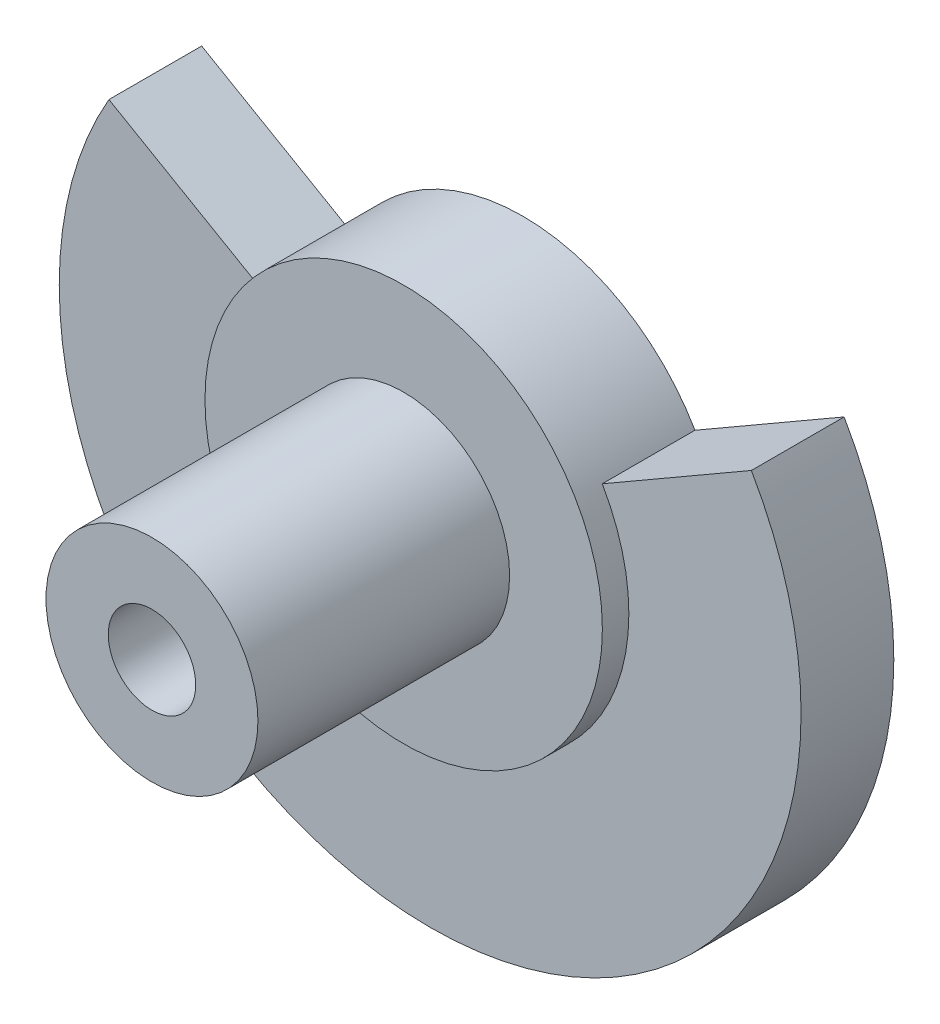
ISO-10303-21;
HEADER;
FILE_DESCRIPTION(('STEP AP214'),'2;1');
FILE_NAME('part.step','',(''),(''),'','','');
FILE_SCHEMA(('AUTOMOTIVE_DESIGN { 1 0 10303 214 1 1 1 1 }'));
ENDSEC;
DATA;
#1=APPLICATION_CONTEXT('core data for automotive mechanical design processes');
#2=APPLICATION_PROTOCOL_DEFINITION('international standard','automotive_design',2000,#1);
#3=PRODUCT_CONTEXT('',#1,'mechanical');
#4=PRODUCT('Part','Part','',(#3));
#5=PRODUCT_RELATED_PRODUCT_CATEGORY('part','',(#4));
#6=PRODUCT_DEFINITION_FORMATION('','',#4);
#7=PRODUCT_DEFINITION_CONTEXT('part definition',#1,'design');
#8=PRODUCT_DEFINITION('design','',#6,#7);
#9=PRODUCT_DEFINITION_SHAPE('','',#8);
#10=(LENGTH_UNIT() NAMED_UNIT(*) SI_UNIT(.MILLI.,.METRE.));
#11=(NAMED_UNIT(*) PLANE_ANGLE_UNIT() SI_UNIT($,.RADIAN.));
#12=(NAMED_UNIT(*) SI_UNIT($,.STERADIAN.) SOLID_ANGLE_UNIT());
#13=UNCERTAINTY_MEASURE_WITH_UNIT(LENGTH_MEASURE(1.E-05),#10,'distance_accuracy_value','');
#14=(GEOMETRIC_REPRESENTATION_CONTEXT(3) GLOBAL_UNCERTAINTY_ASSIGNED_CONTEXT((#13)) GLOBAL_UNIT_ASSIGNED_CONTEXT((#10,
#11,#12)) REPRESENTATION_CONTEXT('',''));
#15=CARTESIAN_POINT('',(0.,0.,0.));
#16=DIRECTION('',(0.,0.,1.));
#17=DIRECTION('',(1.,0.,0.));
#18=AXIS2_PLACEMENT_3D('',#15,#16,#17);
#19=CARTESIAN_POINT('',(0.,0.,14.));
#20=DIRECTION('',(0.,0.,-1.));
#21=DIRECTION('',(-1.,0.,0.));
#22=AXIS2_PLACEMENT_3D('',#19,#20,#21);
#23=CYLINDRICAL_SURFACE('',#22,14.);
#24=CARTESIAN_POINT('',(0.,0.,3.5));
#25=DIRECTION('',(0.,0.,1.));
#26=DIRECTION('',(1.,0.,0.));
#27=AXIS2_PLACEMENT_3D('',#24,#25,#26);
#28=CIRCLE('',#27,14.);
#29=CARTESIAN_POINT('',(-12.1243556529822,6.99999999999997,3.5));
#30=VERTEX_POINT('',#29);
#31=CARTESIAN_POINT('',(12.1243556529822,6.99999999999997,3.5));
#32=VERTEX_POINT('',#31);
#33=EDGE_CURVE('E97',#30,#32,#28,.T.);
#34=ORIENTED_EDGE('',*,*,#33,.F.);
#35=DIRECTION('',(0.,0.,1.));
#36=VECTOR('',#35,1.);
#37=CARTESIAN_POINT('',(-12.1243556529822,6.99999999999997,0.));
#38=LINE('',#37,#36);
#39=CARTESIAN_POINT('',(-12.1243556529822,6.99999999999997,0.));
#40=VERTEX_POINT('',#39);
#41=EDGE_CURVE('E68',#40,#30,#38,.T.);
#42=ORIENTED_EDGE('',*,*,#41,.F.);
#43=CARTESIAN_POINT('',(0.,0.,0.));
#44=DIRECTION('',(0.,0.,1.));
#45=DIRECTION('',(1.,0.,0.));
#46=AXIS2_PLACEMENT_3D('',#43,#44,#45);
#47=CIRCLE('',#46,14.);
#48=CARTESIAN_POINT('',(12.1243556529822,6.99999999999997,0.));
#49=VERTEX_POINT('',#48);
#50=EDGE_CURVE('E11',#40,#49,#47,.T.);
#51=ORIENTED_EDGE('',*,*,#50,.T.);
#52=DIRECTION('',(0.,0.,1.));
#53=VECTOR('',#52,1.);
#54=CARTESIAN_POINT('',(12.1243556529822,6.99999999999997,0.));
#55=LINE('',#54,#53);
#56=EDGE_CURVE('E78',#49,#32,#55,.T.);
#57=ORIENTED_EDGE('',*,*,#56,.T.);
#58=EDGE_LOOP('',(#34,#42,#51,#57));
#59=FACE_BOUND('',#58,.T.);
#60=ADVANCED_FACE('F35',(#59),#23,.T.);
#61=CARTESIAN_POINT('',(0.,0.,4.5));
#62=DIRECTION('',(0.,0.,1.));
#63=DIRECTION('',(1.,0.,0.));
#64=AXIS2_PLACEMENT_3D('',#61,#62,#63);
#65=PLANE('',#64);
#66=CARTESIAN_POINT('',(0.,0.,4.5));
#67=DIRECTION('',(0.,0.,1.));
#68=DIRECTION('',(1.,0.,0.));
#69=AXIS2_PLACEMENT_3D('',#66,#67,#68);
#70=CIRCLE('',#69,4.);
#71=CARTESIAN_POINT('',(4.,0.,4.5));
#72=VERTEX_POINT('',#71);
#73=EDGE_CURVE('E110',#72,#72,#70,.T.);
#74=ORIENTED_EDGE('',*,*,#73,.F.);
#75=EDGE_LOOP('',(#74));
#76=FACE_BOUND('',#75,.T.);
#77=CARTESIAN_POINT('',(0.,0.,4.5));
#78=DIRECTION('',(0.,0.,1.));
#79=DIRECTION('',(1.,0.,0.));
#80=AXIS2_PLACEMENT_3D('',#77,#78,#79);
#81=CIRCLE('',#80,7.5);
#82=CARTESIAN_POINT('',(7.5,0.,4.5));
#83=VERTEX_POINT('',#82);
#84=EDGE_CURVE('E99',#83,#83,#81,.T.);
#85=ORIENTED_EDGE('',*,*,#84,.T.);
#86=EDGE_LOOP('',(#85));
#87=FACE_BOUND('',#86,.T.);
#88=ADVANCED_FACE('F137',(#76,#87),#65,.T.);
#89=CARTESIAN_POINT('',(0.,0.,14.));
#90=DIRECTION('',(0.,0.,1.));
#91=DIRECTION('',(1.,0.,0.));
#92=AXIS2_PLACEMENT_3D('',#89,#90,#91);
#93=PLANE('',#92);
#94=CARTESIAN_POINT('',(0.,0.,14.));
#95=DIRECTION('',(0.,0.,1.));
#96=DIRECTION('',(1.,0.,0.));
#97=AXIS2_PLACEMENT_3D('',#94,#95,#96);
#98=CIRCLE('',#97,1.65);
#99=CARTESIAN_POINT('',(1.65,0.,14.));
#100=VERTEX_POINT('',#99);
#101=EDGE_CURVE('E42',#100,#100,#98,.T.);
#102=ORIENTED_EDGE('',*,*,#101,.F.);
#103=EDGE_LOOP('',(#102));
#104=FACE_BOUND('',#103,.T.);
#105=CARTESIAN_POINT('',(0.,0.,14.));
#106=DIRECTION('',(0.,0.,1.));
#107=DIRECTION('',(1.,0.,0.));
#108=AXIS2_PLACEMENT_3D('',#105,#106,#107);
#109=CIRCLE('',#108,4.);
#110=CARTESIAN_POINT('',(4.,0.,14.));
#111=VERTEX_POINT('',#110);
#112=EDGE_CURVE('E109',#111,#111,#109,.T.);
#113=ORIENTED_EDGE('',*,*,#112,.T.);
#114=EDGE_LOOP('',(#113));
#115=FACE_BOUND('',#114,.T.);
#116=ADVANCED_FACE('F133',(#104,#115),#93,.T.);
#117=CARTESIAN_POINT('',(0.,0.,0.));
#118=DIRECTION('',(0.,0.,1.));
#119=DIRECTION('',(1.,0.,0.));
#120=AXIS2_PLACEMENT_3D('',#117,#118,#119);
#121=PLANE('',#120);
#122=ORIENTED_EDGE('',*,*,#50,.F.);
#123=DIRECTION('',(0.86602540378444,-0.499999999999998,0.));
#124=VECTOR('',#123,1.);
#125=CARTESIAN_POINT('',(-6.4951905283833,3.74999999999998,0.));
#126=LINE('',#125,#124);
#127=CARTESIAN_POINT('',(-6.4951905283833,3.74999999999998,0.));
#128=VERTEX_POINT('',#127);
#129=EDGE_CURVE('E95',#40,#128,#126,.T.);
#130=ORIENTED_EDGE('',*,*,#129,.T.);
#131=CARTESIAN_POINT('',(0.,0.,0.));
#132=DIRECTION('',(0.,0.,-1.));
#133=DIRECTION('',(1.,0.,0.));
#134=AXIS2_PLACEMENT_3D('',#131,#132,#133);
#135=CIRCLE('',#134,7.5);
#136=CARTESIAN_POINT('',(6.4951905283833,3.74999999999999,0.));
#137=VERTEX_POINT('',#136);
#138=EDGE_CURVE('E94',#128,#137,#135,.T.);
#139=ORIENTED_EDGE('',*,*,#138,.T.);
#140=DIRECTION('',(0.86602540378444,0.499999999999998,0.));
#141=VECTOR('',#140,1.);
#142=CARTESIAN_POINT('',(6.4951905283833,3.74999999999999,0.));
#143=LINE('',#142,#141);
#144=EDGE_CURVE('E81',#137,#49,#143,.T.);
#145=ORIENTED_EDGE('',*,*,#144,.T.);
#146=EDGE_LOOP('',(#122,#130,#139,#145));
#147=FACE_BOUND('',#146,.T.);
#148=CARTESIAN_POINT('',(0.,0.,0.));
#149=DIRECTION('',(0.,0.,1.));
#150=DIRECTION('',(1.,0.,0.));
#151=AXIS2_PLACEMENT_3D('',#148,#149,#150);
#152=CIRCLE('',#151,1.65);
#153=CARTESIAN_POINT('',(1.65,0.,0.));
#154=VERTEX_POINT('',#153);
#155=EDGE_CURVE('E113',#154,#154,#152,.T.);
#156=ORIENTED_EDGE('',*,*,#155,.T.);
#157=EDGE_LOOP('',(#156));
#158=FACE_BOUND('',#157,.T.);
#159=ADVANCED_FACE('F91',(#147,#158),#121,.F.);
#160=CARTESIAN_POINT('',(0.,0.,14.));
#161=DIRECTION('',(0.,0.,-1.));
#162=DIRECTION('',(-1.,0.,0.));
#163=AXIS2_PLACEMENT_3D('',#160,#161,#162);
#164=CYLINDRICAL_SURFACE('',#163,1.65);
#165=ORIENTED_EDGE('',*,*,#101,.T.);
#166=EDGE_LOOP('',(#165));
#167=FACE_BOUND('',#166,.T.);
#168=ORIENTED_EDGE('',*,*,#155,.F.);
#169=EDGE_LOOP('',(#168));
#170=FACE_BOUND('',#169,.T.);
#171=ADVANCED_FACE('F120',(#167,#170),#164,.F.);
#172=CARTESIAN_POINT('',(0.,0.,4.5));
#173=DIRECTION('',(0.,0.,1.));
#174=DIRECTION('',(1.,0.,0.));
#175=AXIS2_PLACEMENT_3D('',#172,#173,#174);
#176=CYLINDRICAL_SURFACE('',#175,4.);
#177=ORIENTED_EDGE('',*,*,#73,.T.);
#178=EDGE_LOOP('',(#177));
#179=FACE_BOUND('',#178,.T.);
#180=ORIENTED_EDGE('',*,*,#112,.F.);
#181=EDGE_LOOP('',(#180));
#182=FACE_BOUND('',#181,.T.);
#183=ADVANCED_FACE('F122',(#179,#182),#176,.T.);
#184=CARTESIAN_POINT('',(0.,0.,3.5));
#185=DIRECTION('',(0.,0.,1.));
#186=DIRECTION('',(1.,0.,0.));
#187=AXIS2_PLACEMENT_3D('',#184,#185,#186);
#188=PLANE('',#187);
#189=DIRECTION('',(0.86602540378444,-0.499999999999998,0.));
#190=VECTOR('',#189,1.);
#191=CARTESIAN_POINT('',(-6.4951905283833,3.74999999999998,3.5));
#192=LINE('',#191,#190);
#193=CARTESIAN_POINT('',(-6.4951905283833,3.74999999999998,3.5));
#194=VERTEX_POINT('',#193);
#195=EDGE_CURVE('E49',#30,#194,#192,.T.);
#196=ORIENTED_EDGE('',*,*,#195,.F.);
#197=ORIENTED_EDGE('',*,*,#33,.T.);
#198=DIRECTION('',(0.86602540378444,0.499999999999998,0.));
#199=VECTOR('',#198,1.);
#200=CARTESIAN_POINT('',(6.4951905283833,3.74999999999999,3.5));
#201=LINE('',#200,#199);
#202=CARTESIAN_POINT('',(6.4951905283833,3.74999999999999,3.5));
#203=VERTEX_POINT('',#202);
#204=EDGE_CURVE('E84',#203,#32,#201,.T.);
#205=ORIENTED_EDGE('',*,*,#204,.F.);
#206=CARTESIAN_POINT('',(0.,0.,3.5));
#207=DIRECTION('',(0.,0.,1.));
#208=DIRECTION('',(1.,0.,0.));
#209=AXIS2_PLACEMENT_3D('',#206,#207,#208);
#210=CIRCLE('',#209,7.5);
#211=EDGE_CURVE('E104',#194,#203,#210,.T.);
#212=ORIENTED_EDGE('',*,*,#211,.F.);
#213=EDGE_LOOP('',(#196,#197,#205,#212));
#214=FACE_BOUND('',#213,.T.);
#215=ADVANCED_FACE('F129',(#214),#188,.T.);
#216=CARTESIAN_POINT('',(0.,0.,3.5));
#217=DIRECTION('',(0.,0.,1.));
#218=DIRECTION('',(1.,0.,0.));
#219=AXIS2_PLACEMENT_3D('',#216,#217,#218);
#220=CYLINDRICAL_SURFACE('',#219,7.5);
#221=ORIENTED_EDGE('',*,*,#211,.T.);
#222=DIRECTION('',(0.,0.,1.));
#223=VECTOR('',#222,1.);
#224=CARTESIAN_POINT('',(6.4951905283833,3.74999999999999,0.));
#225=LINE('',#224,#223);
#226=EDGE_CURVE('E73',#137,#203,#225,.T.);
#227=ORIENTED_EDGE('',*,*,#226,.F.);
#228=ORIENTED_EDGE('',*,*,#138,.F.);
#229=DIRECTION('',(0.,0.,1.));
#230=VECTOR('',#229,1.);
#231=CARTESIAN_POINT('',(-6.4951905283833,3.74999999999998,0.));
#232=LINE('',#231,#230);
#233=EDGE_CURVE('E54',#128,#194,#232,.T.);
#234=ORIENTED_EDGE('',*,*,#233,.T.);
#235=EDGE_LOOP('',(#221,#227,#228,#234));
#236=FACE_BOUND('',#235,.T.);
#237=ORIENTED_EDGE('',*,*,#84,.F.);
#238=EDGE_LOOP('',(#237));
#239=FACE_BOUND('',#238,.T.);
#240=ADVANCED_FACE('F151',(#236,#239),#220,.T.);
#241=CARTESIAN_POINT('',(-6.4951905283833,3.74999999999998,0.));
#242=DIRECTION('',(-0.499999999999998,-0.86602540378444,0.));
#243=DIRECTION('',(0.86602540378444,-0.499999999999998,0.));
#244=AXIS2_PLACEMENT_3D('',#241,#242,#243);
#245=PLANE('',#244);
#246=ORIENTED_EDGE('',*,*,#195,.T.);
#247=ORIENTED_EDGE('',*,*,#233,.F.);
#248=ORIENTED_EDGE('',*,*,#129,.F.);
#249=ORIENTED_EDGE('',*,*,#41,.T.);
#250=EDGE_LOOP('',(#246,#247,#248,#249));
#251=FACE_BOUND('',#250,.T.);
#252=ADVANCED_FACE('F155',(#251),#245,.F.);
#253=CARTESIAN_POINT('',(6.4951905283833,3.74999999999999,0.));
#254=DIRECTION('',(0.499999999999998,-0.86602540378444,0.));
#255=DIRECTION('',(0.86602540378444,0.499999999999998,0.));
#256=AXIS2_PLACEMENT_3D('',#253,#254,#255);
#257=PLANE('',#256);
#258=ORIENTED_EDGE('',*,*,#204,.T.);
#259=ORIENTED_EDGE('',*,*,#56,.F.);
#260=ORIENTED_EDGE('',*,*,#144,.F.);
#261=ORIENTED_EDGE('',*,*,#226,.T.);
#262=EDGE_LOOP('',(#258,#259,#260,#261));
#263=FACE_BOUND('',#262,.T.);
#264=ADVANCED_FACE('F80',(#263),#257,.F.);
#265=CLOSED_SHELL('',(#60,#88,#116,#159,#171,#183,#215,#240,#252,#264));
#266=MANIFOLD_SOLID_BREP('B2',#265);
#267=ADVANCED_BREP_SHAPE_REPRESENTATION('',(#18,#266),#14);
#268=SHAPE_DEFINITION_REPRESENTATION(#9,#267);
ENDSEC;
END-ISO-10303-21;
